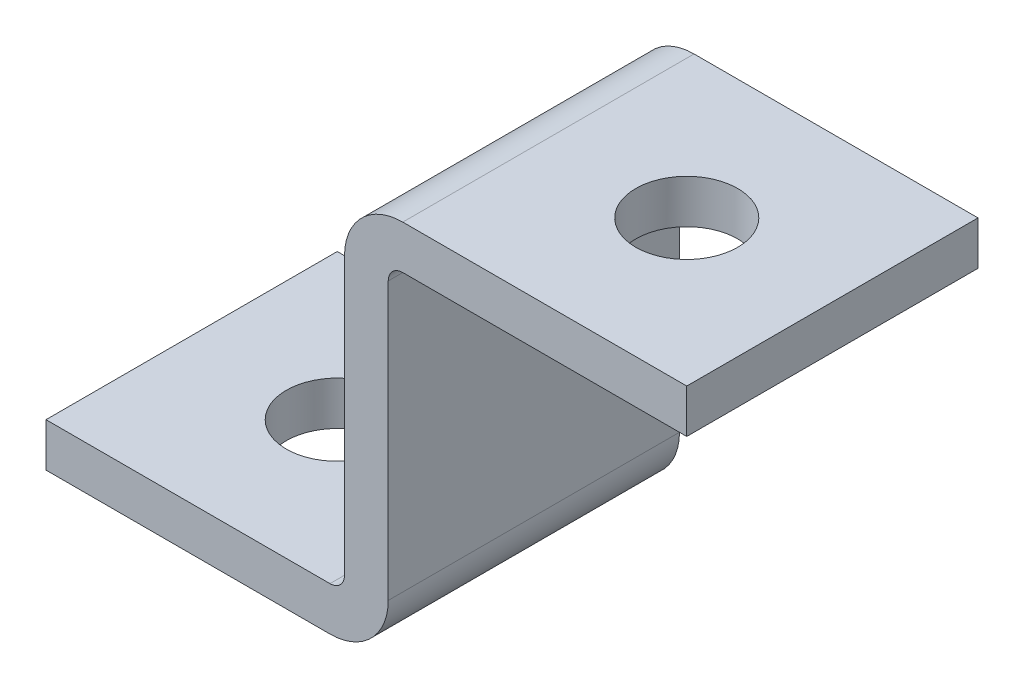
ISO-10303-21;
HEADER;
FILE_DESCRIPTION(('STEP AP214'),'2;1');
FILE_NAME('part.step','',(''),(''),'','','');
FILE_SCHEMA(('AUTOMOTIVE_DESIGN { 1 0 10303 214 1 1 1 1 }'));
ENDSEC;
DATA;
#1=APPLICATION_CONTEXT('core data for automotive mechanical design processes');
#2=APPLICATION_PROTOCOL_DEFINITION('international standard','automotive_design',2000,#1);
#3=PRODUCT_CONTEXT('',#1,'mechanical');
#4=PRODUCT('Part','Part','',(#3));
#5=PRODUCT_RELATED_PRODUCT_CATEGORY('part','',(#4));
#6=PRODUCT_DEFINITION_FORMATION('','',#4);
#7=PRODUCT_DEFINITION_CONTEXT('part definition',#1,'design');
#8=PRODUCT_DEFINITION('design','',#6,#7);
#9=PRODUCT_DEFINITION_SHAPE('','',#8);
#10=(LENGTH_UNIT() NAMED_UNIT(*) SI_UNIT(.MILLI.,.METRE.));
#11=(NAMED_UNIT(*) PLANE_ANGLE_UNIT() SI_UNIT($,.RADIAN.));
#12=(NAMED_UNIT(*) SI_UNIT($,.STERADIAN.) SOLID_ANGLE_UNIT());
#13=UNCERTAINTY_MEASURE_WITH_UNIT(LENGTH_MEASURE(1.E-05),#10,'distance_accuracy_value','');
#14=(GEOMETRIC_REPRESENTATION_CONTEXT(3) GLOBAL_UNCERTAINTY_ASSIGNED_CONTEXT((#13)) GLOBAL_UNIT_ASSIGNED_CONTEXT((#10,
#11,#12)) REPRESENTATION_CONTEXT('',''));
#15=CARTESIAN_POINT('',(0.,0.,0.));
#16=DIRECTION('',(0.,0.,1.));
#17=DIRECTION('',(1.,0.,0.));
#18=AXIS2_PLACEMENT_3D('',#15,#16,#17);
#19=CARTESIAN_POINT('',(0.,53.9999999999999,0.));
#20=DIRECTION('',(0.,1.,0.));
#21=DIRECTION('',(0.,0.,1.));
#22=AXIS2_PLACEMENT_3D('',#19,#20,#21);
#23=PLANE('',#22);
#24=CARTESIAN_POINT('',(68.,53.9999999999999,-20.));
#25=DIRECTION('',(0.,1.,0.));
#26=DIRECTION('',(0.,0.,1.));
#27=AXIS2_PLACEMENT_3D('',#24,#25,#26);
#28=CIRCLE('',#27,6.99999999999998);
#29=CARTESIAN_POINT('',(68.,53.9999999999999,-13.));
#30=VERTEX_POINT('',#29);
#31=EDGE_CURVE('E172',#30,#30,#28,.T.);
#32=ORIENTED_EDGE('',*,*,#31,.F.);
#33=EDGE_LOOP('',(#32));
#34=FACE_BOUND('',#33,.T.);
#35=DIRECTION('',(1.,0.,0.));
#36=VECTOR('',#35,1.);
#37=CARTESIAN_POINT('',(0.,53.9999999999999,-40.));
#38=LINE('',#37,#36);
#39=CARTESIAN_POINT('',(49.0000000000001,53.9999999999999,-40.));
#40=VERTEX_POINT('',#39);
#41=CARTESIAN_POINT('',(88.,53.9999999999999,-40.));
#42=VERTEX_POINT('',#41);
#43=EDGE_CURVE('E148',#40,#42,#38,.T.);
#44=ORIENTED_EDGE('',*,*,#43,.F.);
#45=DIRECTION('',(0.,0.,1.));
#46=VECTOR('',#45,1.);
#47=CARTESIAN_POINT('',(49.0000000000001,53.9999999999999,0.));
#48=LINE('',#47,#46);
#49=CARTESIAN_POINT('',(49.0000000000001,53.9999999999999,0.));
#50=VERTEX_POINT('',#49);
#51=EDGE_CURVE('E43',#40,#50,#48,.T.);
#52=ORIENTED_EDGE('',*,*,#51,.T.);
#53=DIRECTION('',(1.,0.,0.));
#54=VECTOR('',#53,1.);
#55=CARTESIAN_POINT('',(0.,53.9999999999999,0.));
#56=LINE('',#55,#54);
#57=CARTESIAN_POINT('',(88.,53.9999999999999,0.));
#58=VERTEX_POINT('',#57);
#59=EDGE_CURVE('E160',#50,#58,#56,.T.);
#60=ORIENTED_EDGE('',*,*,#59,.T.);
#61=DIRECTION('',(0.,0.,-1.));
#62=VECTOR('',#61,1.);
#63=CARTESIAN_POINT('',(88.,53.9999999999999,0.));
#64=LINE('',#63,#62);
#65=EDGE_CURVE('E165',#58,#42,#64,.T.);
#66=ORIENTED_EDGE('',*,*,#65,.T.);
#67=EDGE_LOOP('',(#44,#52,#60,#66));
#68=FACE_BOUND('',#67,.T.);
#69=ADVANCED_FACE('F35',(#34,#68),#23,.T.);
#70=CARTESIAN_POINT('',(0.,0.,0.));
#71=DIRECTION('',(-1.,0.,0.));
#72=DIRECTION('',(0.,-1.,0.));
#73=AXIS2_PLACEMENT_3D('',#70,#71,#72);
#74=PLANE('',#73);
#75=DIRECTION('',(0.,0.,1.));
#76=VECTOR('',#75,1.);
#77=CARTESIAN_POINT('',(0.,6.,-40.));
#78=LINE('',#77,#76);
#79=CARTESIAN_POINT('',(0.,6.,-40.));
#80=VERTEX_POINT('',#79);
#81=CARTESIAN_POINT('',(0.,6.,0.));
#82=VERTEX_POINT('',#81);
#83=EDGE_CURVE('E154',#80,#82,#78,.T.);
#84=ORIENTED_EDGE('',*,*,#83,.F.);
#85=DIRECTION('',(0.,1.,0.));
#86=VECTOR('',#85,1.);
#87=CARTESIAN_POINT('',(0.,0.,-40.));
#88=LINE('',#87,#86);
#89=CARTESIAN_POINT('',(0.,0.,-40.));
#90=VERTEX_POINT('',#89);
#91=EDGE_CURVE('E152',#90,#80,#88,.T.);
#92=ORIENTED_EDGE('',*,*,#91,.F.);
#93=DIRECTION('',(0.,0.,-1.));
#94=VECTOR('',#93,1.);
#95=CARTESIAN_POINT('',(0.,0.,0.));
#96=LINE('',#95,#94);
#97=CARTESIAN_POINT('',(0.,0.,0.));
#98=VERTEX_POINT('',#97);
#99=EDGE_CURVE('E161',#98,#90,#96,.T.);
#100=ORIENTED_EDGE('',*,*,#99,.F.);
#101=DIRECTION('',(0.,1.,0.));
#102=VECTOR('',#101,1.);
#103=CARTESIAN_POINT('',(0.,0.,0.));
#104=LINE('',#103,#102);
#105=EDGE_CURVE('E167',#98,#82,#104,.T.);
#106=ORIENTED_EDGE('',*,*,#105,.T.);
#107=EDGE_LOOP('',(#84,#92,#100,#106));
#108=FACE_BOUND('',#107,.T.);
#109=ADVANCED_FACE('F220',(#108),#74,.T.);
#110=CARTESIAN_POINT('',(88.,0.,0.));
#111=DIRECTION('',(0.,-1.,0.));
#112=DIRECTION('',(0.,0.,-1.));
#113=AXIS2_PLACEMENT_3D('',#110,#111,#112);
#114=PLANE('',#113);
#115=CARTESIAN_POINT('',(20.,0.,-20.));
#116=DIRECTION('',(0.,-1.,0.));
#117=DIRECTION('',(0.,0.,-1.));
#118=AXIS2_PLACEMENT_3D('',#115,#116,#117);
#119=CIRCLE('',#118,6.99999999999998);
#120=CARTESIAN_POINT('',(20.,0.,-27.));
#121=VERTEX_POINT('',#120);
#122=EDGE_CURVE('E171',#121,#121,#119,.T.);
#123=ORIENTED_EDGE('',*,*,#122,.F.);
#124=EDGE_LOOP('',(#123));
#125=FACE_BOUND('',#124,.T.);
#126=DIRECTION('',(-1.,0.,0.));
#127=VECTOR('',#126,1.);
#128=CARTESIAN_POINT('',(88.,0.,-40.));
#129=LINE('',#128,#127);
#130=CARTESIAN_POINT('',(39.,0.,-40.));
#131=VERTEX_POINT('',#130);
#132=EDGE_CURVE('E150',#131,#90,#129,.T.);
#133=ORIENTED_EDGE('',*,*,#132,.F.);
#134=DIRECTION('',(0.,0.,1.));
#135=VECTOR('',#134,1.);
#136=CARTESIAN_POINT('',(39.,0.,0.));
#137=LINE('',#136,#135);
#138=CARTESIAN_POINT('',(39.,0.,0.));
#139=VERTEX_POINT('',#138);
#140=EDGE_CURVE('E189',#131,#139,#137,.T.);
#141=ORIENTED_EDGE('',*,*,#140,.T.);
#142=DIRECTION('',(-1.,0.,0.));
#143=VECTOR('',#142,1.);
#144=CARTESIAN_POINT('',(88.,0.,0.));
#145=LINE('',#144,#143);
#146=EDGE_CURVE('E210',#139,#98,#145,.T.);
#147=ORIENTED_EDGE('',*,*,#146,.T.);
#148=ORIENTED_EDGE('',*,*,#99,.T.);
#149=EDGE_LOOP('',(#133,#141,#147,#148));
#150=FACE_BOUND('',#149,.T.);
#151=ADVANCED_FACE('F255',(#125,#150),#114,.T.);
#152=CARTESIAN_POINT('',(88.,53.9999999999999,0.));
#153=DIRECTION('',(1.,0.,0.));
#154=DIRECTION('',(0.,0.,-1.));
#155=AXIS2_PLACEMENT_3D('',#152,#153,#154);
#156=PLANE('',#155);
#157=DIRECTION('',(0.,0.,1.));
#158=VECTOR('',#157,1.);
#159=CARTESIAN_POINT('',(88.,48.,-40.));
#160=LINE('',#159,#158);
#161=CARTESIAN_POINT('',(88.,48.,-40.));
#162=VERTEX_POINT('',#161);
#163=CARTESIAN_POINT('',(88.,48.,0.));
#164=VERTEX_POINT('',#163);
#165=EDGE_CURVE('E127',#162,#164,#160,.T.);
#166=ORIENTED_EDGE('',*,*,#165,.F.);
#167=DIRECTION('',(0.,-1.,0.));
#168=VECTOR('',#167,1.);
#169=CARTESIAN_POINT('',(88.,53.9999999999999,-40.));
#170=LINE('',#169,#168);
#171=EDGE_CURVE('E141',#42,#162,#170,.T.);
#172=ORIENTED_EDGE('',*,*,#171,.F.);
#173=ORIENTED_EDGE('',*,*,#65,.F.);
#174=DIRECTION('',(0.,-1.,0.));
#175=VECTOR('',#174,1.);
#176=CARTESIAN_POINT('',(88.,53.9999999999999,0.));
#177=LINE('',#176,#175);
#178=EDGE_CURVE('E143',#58,#164,#177,.T.);
#179=ORIENTED_EDGE('',*,*,#178,.T.);
#180=EDGE_LOOP('',(#166,#172,#173,#179));
#181=FACE_BOUND('',#180,.T.);
#182=ADVANCED_FACE('F139',(#181),#156,.T.);
#183=CARTESIAN_POINT('',(0.,0.,0.));
#184=DIRECTION('',(0.,0.,-1.));
#185=DIRECTION('',(-1.,0.,0.));
#186=AXIS2_PLACEMENT_3D('',#183,#184,#185);
#187=PLANE('',#186);
#188=ORIENTED_EDGE('',*,*,#146,.F.);
#189=CARTESIAN_POINT('',(39.,8.,0.));
#190=DIRECTION('',(0.,0.,-1.));
#191=DIRECTION('',(-1.,0.,0.));
#192=AXIS2_PLACEMENT_3D('',#189,#190,#191);
#193=CIRCLE('',#192,8.);
#194=CARTESIAN_POINT('',(47.,8.,0.));
#195=VERTEX_POINT('',#194);
#196=EDGE_CURVE('E194',#139,#195,#193,.F.);
#197=ORIENTED_EDGE('',*,*,#196,.T.);
#198=DIRECTION('',(0.,-1.,0.));
#199=VECTOR('',#198,1.);
#200=CARTESIAN_POINT('',(47.,48.,0.));
#201=LINE('',#200,#199);
#202=CARTESIAN_POINT('',(47.,46.,0.));
#203=VERTEX_POINT('',#202);
#204=EDGE_CURVE('E134',#203,#195,#201,.T.);
#205=ORIENTED_EDGE('',*,*,#204,.F.);
#206=CARTESIAN_POINT('',(49.,46.,0.));
#207=DIRECTION('',(0.,0.,-1.));
#208=DIRECTION('',(-1.,0.,0.));
#209=AXIS2_PLACEMENT_3D('',#206,#207,#208);
#210=CIRCLE('',#209,2.);
#211=CARTESIAN_POINT('',(49.,48.,0.));
#212=VERTEX_POINT('',#211);
#213=EDGE_CURVE('E181',#203,#212,#210,.T.);
#214=ORIENTED_EDGE('',*,*,#213,.T.);
#215=DIRECTION('',(-1.,0.,0.));
#216=VECTOR('',#215,1.);
#217=CARTESIAN_POINT('',(88.,48.,0.));
#218=LINE('',#217,#216);
#219=EDGE_CURVE('E236',#164,#212,#218,.T.);
#220=ORIENTED_EDGE('',*,*,#219,.F.);
#221=ORIENTED_EDGE('',*,*,#178,.F.);
#222=ORIENTED_EDGE('',*,*,#59,.F.);
#223=CARTESIAN_POINT('',(49.0000000000001,45.9999999999999,0.));
#224=DIRECTION('',(0.,0.,-1.));
#225=DIRECTION('',(-1.,0.,0.));
#226=AXIS2_PLACEMENT_3D('',#223,#224,#225);
#227=CIRCLE('',#226,8.);
#228=CARTESIAN_POINT('',(41.0000000000001,45.9999999999999,0.));
#229=VERTEX_POINT('',#228);
#230=EDGE_CURVE('E192',#50,#229,#227,.F.);
#231=ORIENTED_EDGE('',*,*,#230,.T.);
#232=DIRECTION('',(0.,1.,0.));
#233=VECTOR('',#232,1.);
#234=CARTESIAN_POINT('',(41.0000000000001,6.00000000000001,0.));
#235=LINE('',#234,#233);
#236=CARTESIAN_POINT('',(41.0000000000001,8.00000000000001,0.));
#237=VERTEX_POINT('',#236);
#238=EDGE_CURVE('E226',#237,#229,#235,.T.);
#239=ORIENTED_EDGE('',*,*,#238,.F.);
#240=CARTESIAN_POINT('',(39.0000000000001,8.00000000000001,0.));
#241=DIRECTION('',(0.,0.,-1.));
#242=DIRECTION('',(-1.,0.,0.));
#243=AXIS2_PLACEMENT_3D('',#240,#241,#242);
#244=CIRCLE('',#243,2.);
#245=CARTESIAN_POINT('',(39.0000000000001,6.00000000000001,0.));
#246=VERTEX_POINT('',#245);
#247=EDGE_CURVE('E185',#237,#246,#244,.T.);
#248=ORIENTED_EDGE('',*,*,#247,.T.);
#249=DIRECTION('',(1.,0.,0.));
#250=VECTOR('',#249,1.);
#251=CARTESIAN_POINT('',(0.,6.,0.));
#252=LINE('',#251,#250);
#253=EDGE_CURVE('E144',#82,#246,#252,.T.);
#254=ORIENTED_EDGE('',*,*,#253,.F.);
#255=ORIENTED_EDGE('',*,*,#105,.F.);
#256=EDGE_LOOP('',(#188,#197,#205,#214,#220,#221,#222,#231,#239,#248,#254,#255));
#257=FACE_BOUND('',#256,.T.);
#258=ADVANCED_FACE('F207',(#257),#187,.F.);
#259=CARTESIAN_POINT('',(0.,0.,-40.));
#260=DIRECTION('',(0.,0.,-1.));
#261=DIRECTION('',(-1.,0.,0.));
#262=AXIS2_PLACEMENT_3D('',#259,#260,#261);
#263=PLANE('',#262);
#264=DIRECTION('',(0.,-1.,0.));
#265=VECTOR('',#264,1.);
#266=CARTESIAN_POINT('',(47.,48.,-40.));
#267=LINE('',#266,#265);
#268=CARTESIAN_POINT('',(47.,46.,-40.));
#269=VERTEX_POINT('',#268);
#270=CARTESIAN_POINT('',(47.,8.,-40.));
#271=VERTEX_POINT('',#270);
#272=EDGE_CURVE('E133',#269,#271,#267,.T.);
#273=ORIENTED_EDGE('',*,*,#272,.T.);
#274=CARTESIAN_POINT('',(39.,8.,-40.));
#275=DIRECTION('',(0.,0.,-1.));
#276=DIRECTION('',(-1.,0.,0.));
#277=AXIS2_PLACEMENT_3D('',#274,#275,#276);
#278=CIRCLE('',#277,8.);
#279=EDGE_CURVE('E199',#271,#131,#278,.T.);
#280=ORIENTED_EDGE('',*,*,#279,.T.);
#281=ORIENTED_EDGE('',*,*,#132,.T.);
#282=ORIENTED_EDGE('',*,*,#91,.T.);
#283=DIRECTION('',(1.,0.,0.));
#284=VECTOR('',#283,1.);
#285=CARTESIAN_POINT('',(0.,6.,-40.));
#286=LINE('',#285,#284);
#287=CARTESIAN_POINT('',(39.0000000000001,6.00000000000001,-40.));
#288=VERTEX_POINT('',#287);
#289=EDGE_CURVE('E228',#80,#288,#286,.T.);
#290=ORIENTED_EDGE('',*,*,#289,.T.);
#291=CARTESIAN_POINT('',(39.0000000000001,8.00000000000001,-40.));
#292=DIRECTION('',(0.,0.,-1.));
#293=DIRECTION('',(-1.,0.,0.));
#294=AXIS2_PLACEMENT_3D('',#291,#292,#293);
#295=CIRCLE('',#294,2.);
#296=CARTESIAN_POINT('',(41.0000000000001,8.00000000000001,-40.));
#297=VERTEX_POINT('',#296);
#298=EDGE_CURVE('E187',#288,#297,#295,.F.);
#299=ORIENTED_EDGE('',*,*,#298,.T.);
#300=DIRECTION('',(0.,1.,0.));
#301=VECTOR('',#300,1.);
#302=CARTESIAN_POINT('',(41.0000000000001,6.00000000000001,-40.));
#303=LINE('',#302,#301);
#304=CARTESIAN_POINT('',(41.0000000000001,45.9999999999999,-40.));
#305=VERTEX_POINT('',#304);
#306=EDGE_CURVE('E230',#297,#305,#303,.T.);
#307=ORIENTED_EDGE('',*,*,#306,.T.);
#308=CARTESIAN_POINT('',(49.0000000000001,45.9999999999999,-40.));
#309=DIRECTION('',(0.,0.,-1.));
#310=DIRECTION('',(-1.,0.,0.));
#311=AXIS2_PLACEMENT_3D('',#308,#309,#310);
#312=CIRCLE('',#311,8.);
#313=EDGE_CURVE('E50',#305,#40,#312,.T.);
#314=ORIENTED_EDGE('',*,*,#313,.T.);
#315=ORIENTED_EDGE('',*,*,#43,.T.);
#316=ORIENTED_EDGE('',*,*,#171,.T.);
#317=DIRECTION('',(-1.,0.,0.));
#318=VECTOR('',#317,1.);
#319=CARTESIAN_POINT('',(88.,48.,-40.));
#320=LINE('',#319,#318);
#321=CARTESIAN_POINT('',(49.,48.,-40.));
#322=VERTEX_POINT('',#321);
#323=EDGE_CURVE('E123',#162,#322,#320,.T.);
#324=ORIENTED_EDGE('',*,*,#323,.T.);
#325=CARTESIAN_POINT('',(49.,46.,-40.));
#326=DIRECTION('',(0.,0.,-1.));
#327=DIRECTION('',(-1.,0.,0.));
#328=AXIS2_PLACEMENT_3D('',#325,#326,#327);
#329=CIRCLE('',#328,2.);
#330=EDGE_CURVE('E183',#322,#269,#329,.F.);
#331=ORIENTED_EDGE('',*,*,#330,.T.);
#332=EDGE_LOOP('',(#273,#280,#281,#282,#290,#299,#307,#314,#315,#316,#324,#331));
#333=FACE_BOUND('',#332,.T.);
#334=ADVANCED_FACE('F147',(#333),#263,.T.);
#335=CARTESIAN_POINT('',(0.,6.,-40.));
#336=DIRECTION('',(0.,-1.,0.));
#337=DIRECTION('',(1.,0.,0.));
#338=AXIS2_PLACEMENT_3D('',#335,#336,#337);
#339=PLANE('',#338);
#340=CARTESIAN_POINT('',(20.,6.,-20.));
#341=DIRECTION('',(0.,-1.,0.));
#342=DIRECTION('',(1.,0.,0.));
#343=AXIS2_PLACEMENT_3D('',#340,#341,#342);
#344=CIRCLE('',#343,6.99999999999998);
#345=CARTESIAN_POINT('',(27.,6.00000000000001,-20.));
#346=VERTEX_POINT('',#345);
#347=EDGE_CURVE('E238',#346,#346,#344,.T.);
#348=ORIENTED_EDGE('',*,*,#347,.T.);
#349=EDGE_LOOP('',(#348));
#350=FACE_BOUND('',#349,.T.);
#351=ORIENTED_EDGE('',*,*,#253,.T.);
#352=DIRECTION('',(0.,0.,1.));
#353=VECTOR('',#352,1.);
#354=CARTESIAN_POINT('',(39.0000000000001,6.00000000000001,-40.));
#355=LINE('',#354,#353);
#356=EDGE_CURVE('E179',#246,#288,#355,.F.);
#357=ORIENTED_EDGE('',*,*,#356,.T.);
#358=ORIENTED_EDGE('',*,*,#289,.F.);
#359=ORIENTED_EDGE('',*,*,#83,.T.);
#360=EDGE_LOOP('',(#351,#357,#358,#359));
#361=FACE_BOUND('',#360,.T.);
#362=ADVANCED_FACE('F284',(#350,#361),#339,.F.);
#363=CARTESIAN_POINT('',(41.0000000000001,6.00000000000001,-40.));
#364=DIRECTION('',(1.,0.,0.));
#365=DIRECTION('',(0.,1.,0.));
#366=AXIS2_PLACEMENT_3D('',#363,#364,#365);
#367=PLANE('',#366);
#368=ORIENTED_EDGE('',*,*,#238,.T.);
#369=DIRECTION('',(0.,0.,1.));
#370=VECTOR('',#369,1.);
#371=CARTESIAN_POINT('',(41.0000000000001,45.9999999999999,-40.));
#372=LINE('',#371,#370);
#373=EDGE_CURVE('E11',#229,#305,#372,.F.);
#374=ORIENTED_EDGE('',*,*,#373,.T.);
#375=ORIENTED_EDGE('',*,*,#306,.F.);
#376=DIRECTION('',(0.,0.,1.));
#377=VECTOR('',#376,1.);
#378=CARTESIAN_POINT('',(41.0000000000001,8.00000000000001,0.));
#379=LINE('',#378,#377);
#380=EDGE_CURVE('E176',#297,#237,#379,.T.);
#381=ORIENTED_EDGE('',*,*,#380,.T.);
#382=EDGE_LOOP('',(#368,#374,#375,#381));
#383=FACE_BOUND('',#382,.T.);
#384=ADVANCED_FACE('F281',(#383),#367,.F.);
#385=CARTESIAN_POINT('',(47.,48.,-40.));
#386=DIRECTION('',(-1.,0.,0.));
#387=DIRECTION('',(0.,-1.,0.));
#388=AXIS2_PLACEMENT_3D('',#385,#386,#387);
#389=PLANE('',#388);
#390=ORIENTED_EDGE('',*,*,#204,.T.);
#391=DIRECTION('',(0.,0.,1.));
#392=VECTOR('',#391,1.);
#393=CARTESIAN_POINT('',(47.,8.,-40.));
#394=LINE('',#393,#392);
#395=EDGE_CURVE('E196',#195,#271,#394,.F.);
#396=ORIENTED_EDGE('',*,*,#395,.T.);
#397=ORIENTED_EDGE('',*,*,#272,.F.);
#398=DIRECTION('',(0.,0.,1.));
#399=VECTOR('',#398,1.);
#400=CARTESIAN_POINT('',(47.,46.,0.));
#401=LINE('',#400,#399);
#402=EDGE_CURVE('E164',#269,#203,#401,.T.);
#403=ORIENTED_EDGE('',*,*,#402,.T.);
#404=EDGE_LOOP('',(#390,#396,#397,#403));
#405=FACE_BOUND('',#404,.T.);
#406=ADVANCED_FACE('F283',(#405),#389,.F.);
#407=CARTESIAN_POINT('',(88.,48.,-40.));
#408=DIRECTION('',(0.,1.,0.));
#409=DIRECTION('',(-1.,0.,0.));
#410=AXIS2_PLACEMENT_3D('',#407,#408,#409);
#411=PLANE('',#410);
#412=CARTESIAN_POINT('',(68.,48.,-20.));
#413=DIRECTION('',(0.,1.,0.));
#414=DIRECTION('',(-1.,0.,0.));
#415=AXIS2_PLACEMENT_3D('',#412,#413,#414);
#416=CIRCLE('',#415,6.99999999999998);
#417=CARTESIAN_POINT('',(61.0000000000001,48.,-20.));
#418=VERTEX_POINT('',#417);
#419=EDGE_CURVE('E168',#418,#418,#416,.T.);
#420=ORIENTED_EDGE('',*,*,#419,.T.);
#421=EDGE_LOOP('',(#420));
#422=FACE_BOUND('',#421,.T.);
#423=ORIENTED_EDGE('',*,*,#219,.T.);
#424=DIRECTION('',(0.,0.,1.));
#425=VECTOR('',#424,1.);
#426=CARTESIAN_POINT('',(49.,48.,-40.));
#427=LINE('',#426,#425);
#428=EDGE_CURVE('E130',#212,#322,#427,.F.);
#429=ORIENTED_EDGE('',*,*,#428,.T.);
#430=ORIENTED_EDGE('',*,*,#323,.F.);
#431=ORIENTED_EDGE('',*,*,#165,.T.);
#432=EDGE_LOOP('',(#423,#429,#430,#431));
#433=FACE_BOUND('',#432,.T.);
#434=ADVANCED_FACE('F126',(#422,#433),#411,.F.);
#435=CARTESIAN_POINT('',(20.,0.,-20.));
#436=DIRECTION('',(0.,-1.,0.));
#437=DIRECTION('',(0.,0.,-1.));
#438=AXIS2_PLACEMENT_3D('',#435,#436,#437);
#439=CYLINDRICAL_SURFACE('',#438,6.99999999999998);
#440=ORIENTED_EDGE('',*,*,#122,.T.);
#441=EDGE_LOOP('',(#440));
#442=FACE_BOUND('',#441,.T.);
#443=ORIENTED_EDGE('',*,*,#347,.F.);
#444=EDGE_LOOP('',(#443));
#445=FACE_BOUND('',#444,.T.);
#446=ADVANCED_FACE('F306',(#442,#445),#439,.F.);
#447=CARTESIAN_POINT('',(68.,53.9999999999999,-20.));
#448=DIRECTION('',(0.,1.,0.));
#449=DIRECTION('',(0.,0.,1.));
#450=AXIS2_PLACEMENT_3D('',#447,#448,#449);
#451=CYLINDRICAL_SURFACE('',#450,6.99999999999998);
#452=ORIENTED_EDGE('',*,*,#31,.T.);
#453=EDGE_LOOP('',(#452));
#454=FACE_BOUND('',#453,.T.);
#455=ORIENTED_EDGE('',*,*,#419,.F.);
#456=EDGE_LOOP('',(#455));
#457=FACE_BOUND('',#456,.T.);
#458=ADVANCED_FACE('F247',(#454,#457),#451,.F.);
#459=CARTESIAN_POINT('',(49.,46.,-40.));
#460=DIRECTION('',(0.,0.,-1.));
#461=DIRECTION('',(-1.,0.,0.));
#462=AXIS2_PLACEMENT_3D('',#459,#460,#461);
#463=CYLINDRICAL_SURFACE('',#462,2.);
#464=ORIENTED_EDGE('',*,*,#330,.F.);
#465=ORIENTED_EDGE('',*,*,#428,.F.);
#466=ORIENTED_EDGE('',*,*,#213,.F.);
#467=ORIENTED_EDGE('',*,*,#402,.F.);
#468=EDGE_LOOP('',(#464,#465,#466,#467));
#469=FACE_BOUND('',#468,.T.);
#470=ADVANCED_FACE('F260',(#469),#463,.F.);
#471=CARTESIAN_POINT('',(39.0000000000001,8.00000000000001,-40.));
#472=DIRECTION('',(0.,0.,-1.));
#473=DIRECTION('',(-1.,0.,0.));
#474=AXIS2_PLACEMENT_3D('',#471,#472,#473);
#475=CYLINDRICAL_SURFACE('',#474,2.);
#476=ORIENTED_EDGE('',*,*,#298,.F.);
#477=ORIENTED_EDGE('',*,*,#356,.F.);
#478=ORIENTED_EDGE('',*,*,#247,.F.);
#479=ORIENTED_EDGE('',*,*,#380,.F.);
#480=EDGE_LOOP('',(#476,#477,#478,#479));
#481=FACE_BOUND('',#480,.T.);
#482=ADVANCED_FACE('F263',(#481),#475,.F.);
#483=CARTESIAN_POINT('',(39.,8.,0.));
#484=DIRECTION('',(0.,0.,-1.));
#485=DIRECTION('',(-1.,0.,0.));
#486=AXIS2_PLACEMENT_3D('',#483,#484,#485);
#487=CYLINDRICAL_SURFACE('',#486,8.);
#488=ORIENTED_EDGE('',*,*,#279,.F.);
#489=ORIENTED_EDGE('',*,*,#395,.F.);
#490=ORIENTED_EDGE('',*,*,#196,.F.);
#491=ORIENTED_EDGE('',*,*,#140,.F.);
#492=EDGE_LOOP('',(#488,#489,#490,#491));
#493=FACE_BOUND('',#492,.T.);
#494=ADVANCED_FACE('F266',(#493),#487,.T.);
#495=CARTESIAN_POINT('',(49.0000000000001,45.9999999999999,0.));
#496=DIRECTION('',(0.,0.,-1.));
#497=DIRECTION('',(-1.,0.,0.));
#498=AXIS2_PLACEMENT_3D('',#495,#496,#497);
#499=CYLINDRICAL_SURFACE('',#498,8.);
#500=ORIENTED_EDGE('',*,*,#313,.F.);
#501=ORIENTED_EDGE('',*,*,#373,.F.);
#502=ORIENTED_EDGE('',*,*,#230,.F.);
#503=ORIENTED_EDGE('',*,*,#51,.F.);
#504=EDGE_LOOP('',(#500,#501,#502,#503));
#505=FACE_BOUND('',#504,.T.);
#506=ADVANCED_FACE('F37',(#505),#499,.T.);
#507=CLOSED_SHELL('',(#69,#109,#151,#182,#258,#334,#362,#384,#406,#434,#446,#458,#470,#482,#494,#506));
#508=MANIFOLD_SOLID_BREP('B2',#507);
#509=ADVANCED_BREP_SHAPE_REPRESENTATION('',(#18,#508),#14);
#510=SHAPE_DEFINITION_REPRESENTATION(#9,#509);
ENDSEC;
END-ISO-10303-21;
